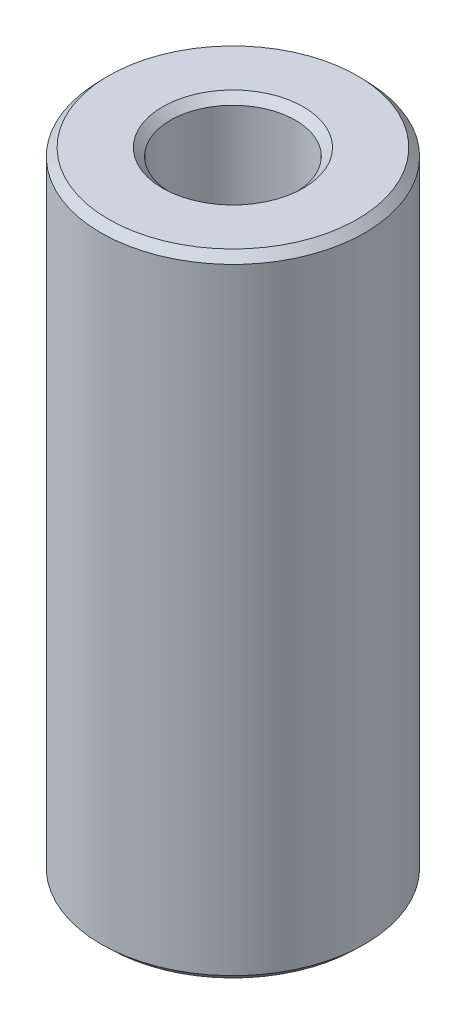
ISO-10303-21;
HEADER;
FILE_DESCRIPTION(('STEP AP214'),'2;1');
FILE_NAME('part.step','',(''),(''),'','','');
FILE_SCHEMA(('AUTOMOTIVE_DESIGN { 1 0 10303 214 1 1 1 1 }'));
ENDSEC;
DATA;
#1=APPLICATION_CONTEXT('core data for automotive mechanical design processes');
#2=APPLICATION_PROTOCOL_DEFINITION('international standard','automotive_design',2000,#1);
#3=PRODUCT_CONTEXT('',#1,'mechanical');
#4=PRODUCT('Part','Part','',(#3));
#5=PRODUCT_RELATED_PRODUCT_CATEGORY('part','',(#4));
#6=PRODUCT_DEFINITION_FORMATION('','',#4);
#7=PRODUCT_DEFINITION_CONTEXT('part definition',#1,'design');
#8=PRODUCT_DEFINITION('design','',#6,#7);
#9=PRODUCT_DEFINITION_SHAPE('','',#8);
#10=(LENGTH_UNIT() NAMED_UNIT(*) SI_UNIT(.MILLI.,.METRE.));
#11=(NAMED_UNIT(*) PLANE_ANGLE_UNIT() SI_UNIT($,.RADIAN.));
#12=(NAMED_UNIT(*) SI_UNIT($,.STERADIAN.) SOLID_ANGLE_UNIT());
#13=UNCERTAINTY_MEASURE_WITH_UNIT(LENGTH_MEASURE(1.E-05),#10,'distance_accuracy_value','');
#14=(GEOMETRIC_REPRESENTATION_CONTEXT(3) GLOBAL_UNCERTAINTY_ASSIGNED_CONTEXT((#13)) GLOBAL_UNIT_ASSIGNED_CONTEXT((#10,
#11,#12)) REPRESENTATION_CONTEXT('',''));
#15=CARTESIAN_POINT('',(0.,0.,0.));
#16=DIRECTION('',(0.,0.,1.));
#17=DIRECTION('',(1.,0.,0.));
#18=AXIS2_PLACEMENT_3D('',#15,#16,#17);
#19=CARTESIAN_POINT('',(0.,227.245825441509,0.));
#20=DIRECTION('',(0.,-1.,0.));
#21=DIRECTION('',(0.,0.,-1.));
#22=AXIS2_PLACEMENT_3D('',#19,#20,#21);
#23=CYLINDRICAL_SURFACE('',#22,47.5);
#24=CARTESIAN_POINT('',(0.,2.74946807338317,0.));
#25=DIRECTION('',(0.,1.,0.));
#26=DIRECTION('',(0.,0.,1.));
#27=AXIS2_PLACEMENT_3D('',#24,#25,#26);
#28=CIRCLE('',#27,47.5);
#29=CARTESIAN_POINT('',(0.,2.74946807338317,47.5));
#30=VERTEX_POINT('',#29);
#31=EDGE_CURVE('E10',#30,#30,#28,.T.);
#32=ORIENTED_EDGE('',*,*,#31,.T.);
#33=EDGE_LOOP('',(#32));
#34=FACE_BOUND('',#33,.T.);
#35=CARTESIAN_POINT('',(0.,224.387836632001,0.));
#36=DIRECTION('',(0.,1.,0.));
#37=DIRECTION('',(0.,0.,1.));
#38=AXIS2_PLACEMENT_3D('',#35,#36,#37);
#39=CIRCLE('',#38,47.5);
#40=CARTESIAN_POINT('',(0.,224.387836632001,47.5));
#41=VERTEX_POINT('',#40);
#42=EDGE_CURVE('E50',#41,#41,#39,.F.);
#43=ORIENTED_EDGE('',*,*,#42,.T.);
#44=EDGE_LOOP('',(#43));
#45=FACE_BOUND('',#44,.T.);
#46=ADVANCED_FACE('F39',(#34,#45),#23,.T.);
#47=CARTESIAN_POINT('',(0.,227.245825441509,0.));
#48=DIRECTION('',(0.,1.,0.));
#49=DIRECTION('',(0.,0.,1.));
#50=AXIS2_PLACEMENT_3D('',#47,#48,#49);
#51=PLANE('',#50);
#52=CARTESIAN_POINT('',(0.,227.245825441509,0.));
#53=DIRECTION('',(0.,1.,0.));
#54=DIRECTION('',(0.,0.,1.));
#55=AXIS2_PLACEMENT_3D('',#52,#53,#54);
#56=CIRCLE('',#55,25.3571897082206);
#57=CARTESIAN_POINT('',(0.,227.245825441509,25.3571897082206));
#58=VERTEX_POINT('',#57);
#59=EDGE_CURVE('E58',#58,#58,#56,.F.);
#60=ORIENTED_EDGE('',*,*,#59,.T.);
#61=EDGE_LOOP('',(#60));
#62=FACE_BOUND('',#61,.T.);
#63=CARTESIAN_POINT('',(0.,227.245825441509,0.));
#64=DIRECTION('',(0.,1.,0.));
#65=DIRECTION('',(0.,0.,1.));
#66=AXIS2_PLACEMENT_3D('',#63,#64,#65);
#67=CIRCLE('',#66,44.7505319266167);
#68=CARTESIAN_POINT('',(0.,227.245825441509,44.7505319266167));
#69=VERTEX_POINT('',#68);
#70=EDGE_CURVE('E61',#69,#69,#67,.T.);
#71=ORIENTED_EDGE('',*,*,#70,.T.);
#72=EDGE_LOOP('',(#71));
#73=FACE_BOUND('',#72,.T.);
#74=ADVANCED_FACE('F88',(#62,#73),#51,.T.);
#75=CARTESIAN_POINT('',(0.,0.,0.));
#76=DIRECTION('',(0.,1.,0.));
#77=DIRECTION('',(0.,0.,1.));
#78=AXIS2_PLACEMENT_3D('',#75,#76,#77);
#79=PLANE('',#78);
#80=CARTESIAN_POINT('',(0.,0.,0.));
#81=DIRECTION('',(0.,1.,0.));
#82=DIRECTION('',(0.,0.,1.));
#83=AXIS2_PLACEMENT_3D('',#80,#81,#82);
#84=CIRCLE('',#83,25.2486689720963);
#85=CARTESIAN_POINT('',(0.,0.,25.2486689720963));
#86=VERTEX_POINT('',#85);
#87=EDGE_CURVE('E51',#86,#86,#84,.T.);
#88=ORIENTED_EDGE('',*,*,#87,.T.);
#89=EDGE_LOOP('',(#88));
#90=FACE_BOUND('',#89,.T.);
#91=CARTESIAN_POINT('',(0.,0.,0.));
#92=DIRECTION('',(0.,1.,0.));
#93=DIRECTION('',(0.,0.,1.));
#94=AXIS2_PLACEMENT_3D('',#91,#92,#93);
#95=CIRCLE('',#94,44.6420111904925);
#96=CARTESIAN_POINT('',(0.,0.,44.6420111904925));
#97=VERTEX_POINT('',#96);
#98=EDGE_CURVE('E54',#97,#97,#95,.F.);
#99=ORIENTED_EDGE('',*,*,#98,.T.);
#100=EDGE_LOOP('',(#99));
#101=FACE_BOUND('',#100,.T.);
#102=ADVANCED_FACE('F83',(#90,#101),#79,.F.);
#103=CARTESIAN_POINT('',(0.,227.245825441509,0.));
#104=DIRECTION('',(0.,-1.,0.));
#105=DIRECTION('',(0.,0.,-1.));
#106=AXIS2_PLACEMENT_3D('',#103,#104,#105);
#107=CYLINDRICAL_SURFACE('',#106,22.4992008987131);
#108=CARTESIAN_POINT('',(0.,224.496357368126,0.));
#109=DIRECTION('',(0.,1.,0.));
#110=DIRECTION('',(0.,0.,1.));
#111=AXIS2_PLACEMENT_3D('',#108,#109,#110);
#112=CIRCLE('',#111,22.4992008987131);
#113=CARTESIAN_POINT('',(0.,224.496357368126,22.4992008987131));
#114=VERTEX_POINT('',#113);
#115=EDGE_CURVE('E67',#114,#114,#112,.T.);
#116=ORIENTED_EDGE('',*,*,#115,.T.);
#117=EDGE_LOOP('',(#116));
#118=FACE_BOUND('',#117,.T.);
#119=CARTESIAN_POINT('',(0.,2.85798880950755,0.));
#120=DIRECTION('',(0.,1.,0.));
#121=DIRECTION('',(0.,0.,1.));
#122=AXIS2_PLACEMENT_3D('',#119,#120,#121);
#123=CIRCLE('',#122,22.4992008987131);
#124=CARTESIAN_POINT('',(0.,2.85798880950755,22.4992008987131));
#125=VERTEX_POINT('',#124);
#126=EDGE_CURVE('E69',#125,#125,#123,.F.);
#127=ORIENTED_EDGE('',*,*,#126,.T.);
#128=EDGE_LOOP('',(#127));
#129=FACE_BOUND('',#128,.T.);
#130=ADVANCED_FACE('F71',(#118,#129),#107,.F.);
#131=CARTESIAN_POINT('',(0.,224.496357368126,0.));
#132=DIRECTION('',(0.,1.,0.));
#133=DIRECTION('',(0.,0.,1.));
#134=AXIS2_PLACEMENT_3D('',#131,#132,#133);
#135=CONICAL_SURFACE('',#134,22.4992008987131,0.804748680597399);
#136=ORIENTED_EDGE('',*,*,#59,.F.);
#137=EDGE_LOOP('',(#136));
#138=FACE_BOUND('',#137,.T.);
#139=ORIENTED_EDGE('',*,*,#115,.F.);
#140=EDGE_LOOP('',(#139));
#141=FACE_BOUND('',#140,.T.);
#142=ADVANCED_FACE('F77',(#138,#141),#135,.F.);
#143=CARTESIAN_POINT('',(0.,0.,0.));
#144=DIRECTION('',(0.,-1.,0.));
#145=DIRECTION('',(0.,0.,-1.));
#146=AXIS2_PLACEMENT_3D('',#143,#144,#145);
#147=CONICAL_SURFACE('',#146,25.2486689720963,0.766047646197497);
#148=ORIENTED_EDGE('',*,*,#126,.F.);
#149=EDGE_LOOP('',(#148));
#150=FACE_BOUND('',#149,.T.);
#151=ORIENTED_EDGE('',*,*,#87,.F.);
#152=EDGE_LOOP('',(#151));
#153=FACE_BOUND('',#152,.T.);
#154=ADVANCED_FACE('F73',(#150,#153),#147,.F.);
#155=CARTESIAN_POINT('',(0.,2.74946807338317,0.));
#156=DIRECTION('',(0.,1.,0.));
#157=DIRECTION('',(0.,0.,1.));
#158=AXIS2_PLACEMENT_3D('',#155,#156,#157);
#159=CONICAL_SURFACE('',#158,47.5,0.804748680597402);
#160=ORIENTED_EDGE('',*,*,#98,.F.);
#161=EDGE_LOOP('',(#160));
#162=FACE_BOUND('',#161,.T.);
#163=ORIENTED_EDGE('',*,*,#31,.F.);
#164=EDGE_LOOP('',(#163));
#165=FACE_BOUND('',#164,.T.);
#166=ADVANCED_FACE('F76',(#162,#165),#159,.T.);
#167=CARTESIAN_POINT('',(0.,227.245825441509,0.));
#168=DIRECTION('',(0.,-1.,0.));
#169=DIRECTION('',(0.,0.,-1.));
#170=AXIS2_PLACEMENT_3D('',#167,#168,#169);
#171=CONICAL_SURFACE('',#170,44.7505319266167,0.766047646197494);
#172=ORIENTED_EDGE('',*,*,#42,.F.);
#173=EDGE_LOOP('',(#172));
#174=FACE_BOUND('',#173,.T.);
#175=ORIENTED_EDGE('',*,*,#70,.F.);
#176=EDGE_LOOP('',(#175));
#177=FACE_BOUND('',#176,.T.);
#178=ADVANCED_FACE('F45',(#174,#177),#171,.T.);
#179=CLOSED_SHELL('',(#46,#74,#102,#130,#142,#154,#166,#178));
#180=MANIFOLD_SOLID_BREP('B2',#179);
#181=ADVANCED_BREP_SHAPE_REPRESENTATION('',(#18,#180),#14);
#182=SHAPE_DEFINITION_REPRESENTATION(#9,#181);
ENDSEC;
END-ISO-10303-21;
